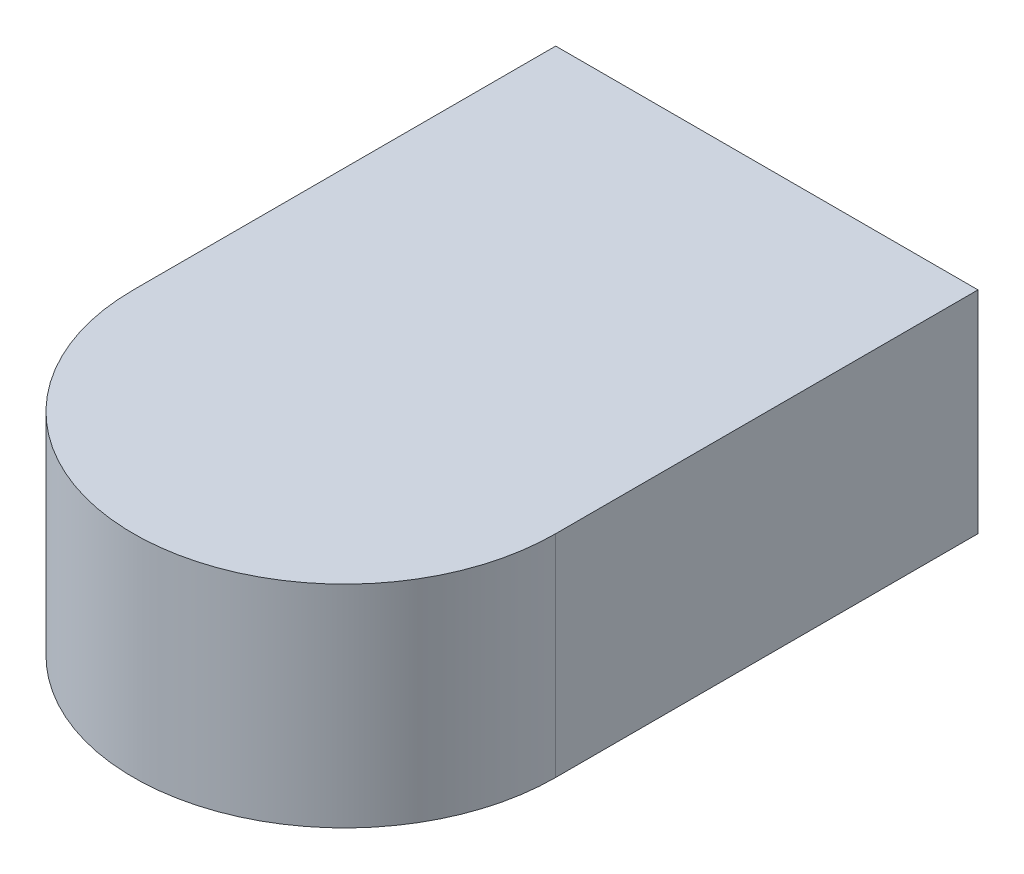
ISO-10303-21;
HEADER;
FILE_DESCRIPTION(('STEP AP214'),'2;1');
FILE_NAME('part.step','',(''),(''),'','','');
FILE_SCHEMA(('AUTOMOTIVE_DESIGN { 1 0 10303 214 1 1 1 1 }'));
ENDSEC;
DATA;
#1=APPLICATION_CONTEXT('core data for automotive mechanical design processes');
#2=APPLICATION_PROTOCOL_DEFINITION('international standard','automotive_design',2000,#1);
#3=PRODUCT_CONTEXT('',#1,'mechanical');
#4=PRODUCT('Part','Part','',(#3));
#5=PRODUCT_RELATED_PRODUCT_CATEGORY('part','',(#4));
#6=PRODUCT_DEFINITION_FORMATION('','',#4);
#7=PRODUCT_DEFINITION_CONTEXT('part definition',#1,'design');
#8=PRODUCT_DEFINITION('design','',#6,#7);
#9=PRODUCT_DEFINITION_SHAPE('','',#8);
#10=(LENGTH_UNIT() NAMED_UNIT(*) SI_UNIT(.MILLI.,.METRE.));
#11=(NAMED_UNIT(*) PLANE_ANGLE_UNIT() SI_UNIT($,.RADIAN.));
#12=(NAMED_UNIT(*) SI_UNIT($,.STERADIAN.) SOLID_ANGLE_UNIT());
#13=UNCERTAINTY_MEASURE_WITH_UNIT(LENGTH_MEASURE(1.E-05),#10,'distance_accuracy_value','');
#14=(GEOMETRIC_REPRESENTATION_CONTEXT(3) GLOBAL_UNCERTAINTY_ASSIGNED_CONTEXT((#13)) GLOBAL_UNIT_ASSIGNED_CONTEXT((#10,
#11,#12)) REPRESENTATION_CONTEXT('',''));
#15=CARTESIAN_POINT('',(0.,0.,0.));
#16=DIRECTION('',(0.,0.,1.));
#17=DIRECTION('',(1.,0.,0.));
#18=AXIS2_PLACEMENT_3D('',#15,#16,#17);
#19=CARTESIAN_POINT('',(0.,0.,0.));
#20=DIRECTION('',(0.,1.,0.));
#21=DIRECTION('',(1.,0.,0.));
#22=AXIS2_PLACEMENT_3D('',#19,#20,#21);
#23=PLANE('',#22);
#24=DIRECTION('',(-1.,0.,0.));
#25=VECTOR('',#24,1.);
#26=CARTESIAN_POINT('',(0.1,0.,-2.25));
#27=LINE('',#26,#25);
#28=CARTESIAN_POINT('',(0.1,0.,-2.25));
#29=VERTEX_POINT('',#28);
#30=CARTESIAN_POINT('',(-0.1,0.,-2.25));
#31=VERTEX_POINT('',#30);
#32=EDGE_CURVE('E11',#29,#31,#27,.T.);
#33=ORIENTED_EDGE('',*,*,#32,.F.);
#34=DIRECTION('',(0.,0.,-1.));
#35=VECTOR('',#34,1.);
#36=CARTESIAN_POINT('',(0.1,0.,-2.05));
#37=LINE('',#36,#35);
#38=CARTESIAN_POINT('',(0.1,0.,-2.05));
#39=VERTEX_POINT('',#38);
#40=EDGE_CURVE('E25',#39,#29,#37,.T.);
#41=ORIENTED_EDGE('',*,*,#40,.F.);
#42=CARTESIAN_POINT('',(0.,0.,-2.05));
#43=DIRECTION('',(0.,1.,0.));
#44=DIRECTION('',(-1.,0.,0.));
#45=AXIS2_PLACEMENT_3D('',#42,#43,#44);
#46=CIRCLE('',#45,0.1);
#47=CARTESIAN_POINT('',(-0.1,0.,-2.05));
#48=VERTEX_POINT('',#47);
#49=EDGE_CURVE('E73',#48,#39,#46,.T.);
#50=ORIENTED_EDGE('',*,*,#49,.F.);
#51=DIRECTION('',(0.,0.,1.));
#52=VECTOR('',#51,1.);
#53=CARTESIAN_POINT('',(-0.1,0.,-2.25));
#54=LINE('',#53,#52);
#55=EDGE_CURVE('E99',#31,#48,#54,.T.);
#56=ORIENTED_EDGE('',*,*,#55,.F.);
#57=EDGE_LOOP('',(#33,#41,#50,#56));
#58=FACE_BOUND('',#57,.T.);
#59=ADVANCED_FACE('F17',(#58),#23,.F.);
#60=CARTESIAN_POINT('',(-0.1,0.,-2.25));
#61=DIRECTION('',(-1.,0.,0.));
#62=DIRECTION('',(0.,0.,1.));
#63=AXIS2_PLACEMENT_3D('',#60,#61,#62);
#64=PLANE('',#63);
#65=DIRECTION('',(0.,1.,0.));
#66=VECTOR('',#65,1.);
#67=CARTESIAN_POINT('',(-0.1,0.,-2.05));
#68=LINE('',#67,#66);
#69=CARTESIAN_POINT('',(-0.1,0.1,-2.05));
#70=VERTEX_POINT('',#69);
#71=EDGE_CURVE('E95',#48,#70,#68,.T.);
#72=ORIENTED_EDGE('',*,*,#71,.T.);
#73=DIRECTION('',(0.,0.,1.));
#74=VECTOR('',#73,1.);
#75=CARTESIAN_POINT('',(-0.1,0.1,-2.25));
#76=LINE('',#75,#74);
#77=CARTESIAN_POINT('',(-0.1,0.1,-2.25));
#78=VERTEX_POINT('',#77);
#79=EDGE_CURVE('E68',#78,#70,#76,.T.);
#80=ORIENTED_EDGE('',*,*,#79,.F.);
#81=DIRECTION('',(0.,1.,0.));
#82=VECTOR('',#81,1.);
#83=CARTESIAN_POINT('',(-0.1,0.,-2.25));
#84=LINE('',#83,#82);
#85=EDGE_CURVE('E87',#31,#78,#84,.T.);
#86=ORIENTED_EDGE('',*,*,#85,.F.);
#87=ORIENTED_EDGE('',*,*,#55,.T.);
#88=EDGE_LOOP('',(#72,#80,#86,#87));
#89=FACE_BOUND('',#88,.T.);
#90=ADVANCED_FACE('F113',(#89),#64,.T.);
#91=CARTESIAN_POINT('',(0.1,0.,-2.25));
#92=DIRECTION('',(0.,0.,-1.));
#93=DIRECTION('',(-1.,0.,0.));
#94=AXIS2_PLACEMENT_3D('',#91,#92,#93);
#95=PLANE('',#94);
#96=ORIENTED_EDGE('',*,*,#85,.T.);
#97=DIRECTION('',(-1.,0.,0.));
#98=VECTOR('',#97,1.);
#99=CARTESIAN_POINT('',(0.1,0.1,-2.25));
#100=LINE('',#99,#98);
#101=CARTESIAN_POINT('',(0.1,0.1,-2.25));
#102=VERTEX_POINT('',#101);
#103=EDGE_CURVE('E83',#102,#78,#100,.T.);
#104=ORIENTED_EDGE('',*,*,#103,.F.);
#105=DIRECTION('',(0.,1.,0.));
#106=VECTOR('',#105,1.);
#107=CARTESIAN_POINT('',(0.1,0.,-2.25));
#108=LINE('',#107,#106);
#109=EDGE_CURVE('E60',#29,#102,#108,.T.);
#110=ORIENTED_EDGE('',*,*,#109,.F.);
#111=ORIENTED_EDGE('',*,*,#32,.T.);
#112=EDGE_LOOP('',(#96,#104,#110,#111));
#113=FACE_BOUND('',#112,.T.);
#114=ADVANCED_FACE('F119',(#113),#95,.T.);
#115=CARTESIAN_POINT('',(0.1,0.,-2.05));
#116=DIRECTION('',(1.,0.,0.));
#117=DIRECTION('',(0.,0.,-1.));
#118=AXIS2_PLACEMENT_3D('',#115,#116,#117);
#119=PLANE('',#118);
#120=ORIENTED_EDGE('',*,*,#109,.T.);
#121=DIRECTION('',(0.,0.,-1.));
#122=VECTOR('',#121,1.);
#123=CARTESIAN_POINT('',(0.1,0.1,-2.05));
#124=LINE('',#123,#122);
#125=CARTESIAN_POINT('',(0.1,0.1,-2.05));
#126=VERTEX_POINT('',#125);
#127=EDGE_CURVE('E54',#126,#102,#124,.T.);
#128=ORIENTED_EDGE('',*,*,#127,.F.);
#129=DIRECTION('',(0.,1.,0.));
#130=VECTOR('',#129,1.);
#131=CARTESIAN_POINT('',(0.1,0.,-2.05));
#132=LINE('',#131,#130);
#133=EDGE_CURVE('E58',#39,#126,#132,.T.);
#134=ORIENTED_EDGE('',*,*,#133,.F.);
#135=ORIENTED_EDGE('',*,*,#40,.T.);
#136=EDGE_LOOP('',(#120,#128,#134,#135));
#137=FACE_BOUND('',#136,.T.);
#138=ADVANCED_FACE('F56',(#137),#119,.T.);
#139=CARTESIAN_POINT('',(0.,0.,-2.05));
#140=DIRECTION('',(0.,1.,0.));
#141=DIRECTION('',(0.,0.,-1.));
#142=AXIS2_PLACEMENT_3D('',#139,#140,#141);
#143=CYLINDRICAL_SURFACE('',#142,0.1);
#144=ORIENTED_EDGE('',*,*,#133,.T.);
#145=CARTESIAN_POINT('',(0.,0.1,-2.05));
#146=DIRECTION('',(0.,1.,0.));
#147=DIRECTION('',(-1.,0.,0.));
#148=AXIS2_PLACEMENT_3D('',#145,#146,#147);
#149=CIRCLE('',#148,0.1);
#150=EDGE_CURVE('E66',#70,#126,#149,.T.);
#151=ORIENTED_EDGE('',*,*,#150,.F.);
#152=ORIENTED_EDGE('',*,*,#71,.F.);
#153=ORIENTED_EDGE('',*,*,#49,.T.);
#154=EDGE_LOOP('',(#144,#151,#152,#153));
#155=FACE_BOUND('',#154,.T.);
#156=ADVANCED_FACE('F72',(#155),#143,.T.);
#157=CARTESIAN_POINT('',(0.,0.1,0.));
#158=DIRECTION('',(0.,1.,0.));
#159=DIRECTION('',(1.,0.,0.));
#160=AXIS2_PLACEMENT_3D('',#157,#158,#159);
#161=PLANE('',#160);
#162=ORIENTED_EDGE('',*,*,#150,.T.);
#163=ORIENTED_EDGE('',*,*,#127,.T.);
#164=ORIENTED_EDGE('',*,*,#103,.T.);
#165=ORIENTED_EDGE('',*,*,#79,.T.);
#166=EDGE_LOOP('',(#162,#163,#164,#165));
#167=FACE_BOUND('',#166,.T.);
#168=ADVANCED_FACE('F67',(#167),#161,.T.);
#169=CLOSED_SHELL('',(#59,#90,#114,#138,#156,#168));
#170=MANIFOLD_SOLID_BREP('B1',#169);
#171=ADVANCED_BREP_SHAPE_REPRESENTATION('',(#18,#170),#14);
#172=SHAPE_DEFINITION_REPRESENTATION(#9,#171);
ENDSEC;
END-ISO-10303-21;
